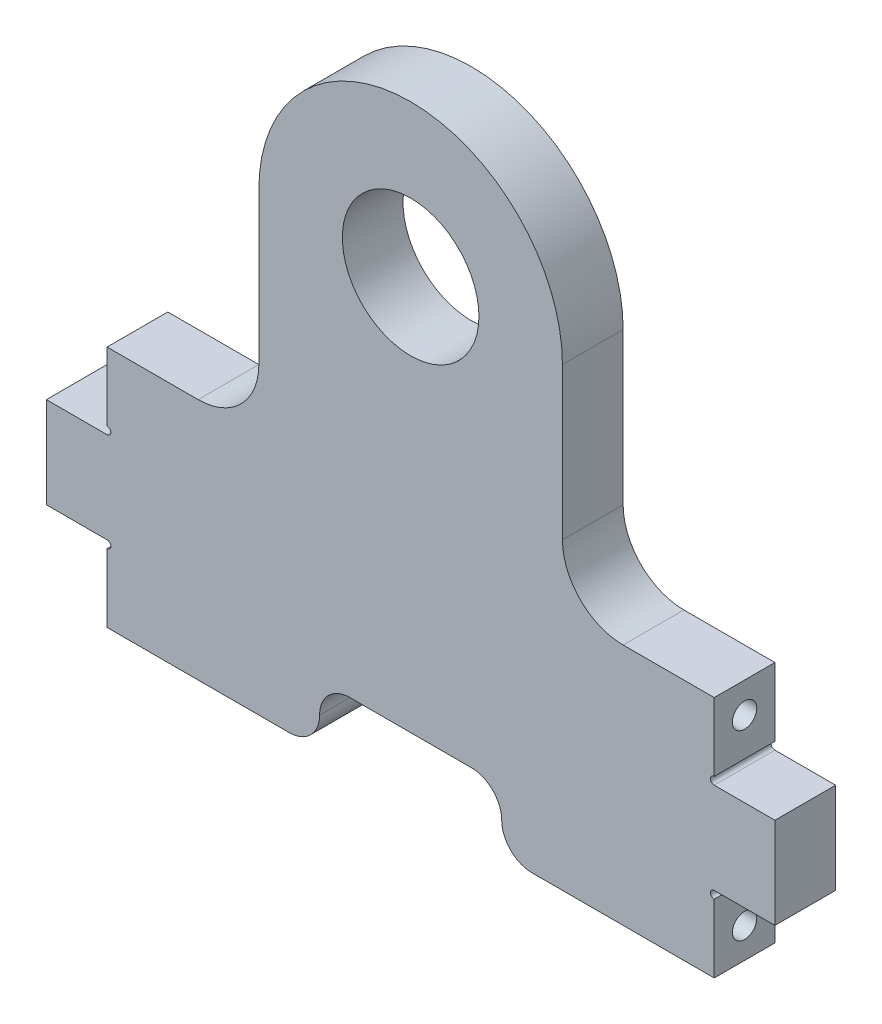
ISO-10303-21;
HEADER;
FILE_DESCRIPTION(('STEP AP214'),'2;1');
FILE_NAME('part.step','',(''),(''),'','','');
FILE_SCHEMA(('AUTOMOTIVE_DESIGN { 1 0 10303 214 1 1 1 1 }'));
ENDSEC;
DATA;
#1=APPLICATION_CONTEXT('core data for automotive mechanical design processes');
#2=APPLICATION_PROTOCOL_DEFINITION('international standard','automotive_design',2000,#1);
#3=PRODUCT_CONTEXT('',#1,'mechanical');
#4=PRODUCT('Part','Part','',(#3));
#5=PRODUCT_RELATED_PRODUCT_CATEGORY('part','',(#4));
#6=PRODUCT_DEFINITION_FORMATION('','',#4);
#7=PRODUCT_DEFINITION_CONTEXT('part definition',#1,'design');
#8=PRODUCT_DEFINITION('design','',#6,#7);
#9=PRODUCT_DEFINITION_SHAPE('','',#8);
#10=(LENGTH_UNIT() NAMED_UNIT(*) SI_UNIT(.MILLI.,.METRE.));
#11=(NAMED_UNIT(*) PLANE_ANGLE_UNIT() SI_UNIT($,.RADIAN.));
#12=(NAMED_UNIT(*) SI_UNIT($,.STERADIAN.) SOLID_ANGLE_UNIT());
#13=UNCERTAINTY_MEASURE_WITH_UNIT(LENGTH_MEASURE(1.E-05),#10,'distance_accuracy_value','');
#14=(GEOMETRIC_REPRESENTATION_CONTEXT(3) GLOBAL_UNCERTAINTY_ASSIGNED_CONTEXT((#13)) GLOBAL_UNIT_ASSIGNED_CONTEXT((#10,
#11,#12)) REPRESENTATION_CONTEXT('',''));
#15=CARTESIAN_POINT('',(0.,0.,0.));
#16=DIRECTION('',(0.,0.,1.));
#17=DIRECTION('',(1.,0.,0.));
#18=AXIS2_PLACEMENT_3D('',#15,#16,#17);
#19=CARTESIAN_POINT('',(-63.5,0.,12.7));
#20=DIRECTION('',(0.,1.,0.));
#21=DIRECTION('',(0.,0.,1.));
#22=AXIS2_PLACEMENT_3D('',#19,#20,#21);
#23=PLANE('',#22);
#24=DIRECTION('',(1.,0.,0.));
#25=VECTOR('',#24,1.);
#26=CARTESIAN_POINT('',(-63.5,0.,0.));
#27=LINE('',#26,#25);
#28=CARTESIAN_POINT('',(-63.5,0.,0.));
#29=VERTEX_POINT('',#28);
#30=CARTESIAN_POINT('',(-25.4,0.,0.));
#31=VERTEX_POINT('',#30);
#32=EDGE_CURVE('E293',#29,#31,#27,.T.);
#33=ORIENTED_EDGE('',*,*,#32,.T.);
#34=DIRECTION('',(0.,0.,1.));
#35=VECTOR('',#34,1.);
#36=CARTESIAN_POINT('',(-25.4,0.,12.7));
#37=LINE('',#36,#35);
#38=CARTESIAN_POINT('',(-25.4,0.,12.7));
#39=VERTEX_POINT('',#38);
#40=EDGE_CURVE('E496',#31,#39,#37,.T.);
#41=ORIENTED_EDGE('',*,*,#40,.T.);
#42=DIRECTION('',(1.,0.,0.));
#43=VECTOR('',#42,1.);
#44=CARTESIAN_POINT('',(-63.5,0.,12.7));
#45=LINE('',#44,#43);
#46=CARTESIAN_POINT('',(-63.5,0.,12.7));
#47=VERTEX_POINT('',#46);
#48=EDGE_CURVE('E276',#47,#39,#45,.T.);
#49=ORIENTED_EDGE('',*,*,#48,.F.);
#50=DIRECTION('',(0.,0.,-1.));
#51=VECTOR('',#50,1.);
#52=CARTESIAN_POINT('',(-63.5,0.,12.7));
#53=LINE('',#52,#51);
#54=EDGE_CURVE('E253',#47,#29,#53,.T.);
#55=ORIENTED_EDGE('',*,*,#54,.T.);
#56=EDGE_LOOP('',(#33,#41,#49,#55));
#57=FACE_BOUND('',#56,.T.);
#58=ADVANCED_FACE('F33',(#57),#23,.F.);
#59=CARTESIAN_POINT('',(0.,0.,12.7));
#60=DIRECTION('',(0.,0.,-1.));
#61=DIRECTION('',(-1.,0.,0.));
#62=AXIS2_PLACEMENT_3D('',#59,#60,#61);
#63=PLANE('',#62);
#64=CARTESIAN_POINT('',(-2.22044604925031E-13,95.2499999999994,12.7));
#65=DIRECTION('',(0.,0.,1.));
#66=DIRECTION('',(1.,0.,0.));
#67=AXIS2_PLACEMENT_3D('',#64,#65,#66);
#68=CIRCLE('',#67,14.2875);
#69=CARTESIAN_POINT('',(14.2874999999998,95.2499999999994,12.7));
#70=VERTEX_POINT('',#69);
#71=EDGE_CURVE('E274',#70,#70,#68,.T.);
#72=ORIENTED_EDGE('',*,*,#71,.F.);
#73=EDGE_LOOP('',(#72));
#74=FACE_BOUND('',#73,.T.);
#75=DIRECTION('',(-1.,0.,0.));
#76=VECTOR('',#75,1.);
#77=CARTESIAN_POINT('',(-19.05,12.7,12.7));
#78=LINE('',#77,#76);
#79=CARTESIAN_POINT('',(12.7,12.7,12.7));
#80=VERTEX_POINT('',#79);
#81=CARTESIAN_POINT('',(-12.7,12.7,12.7));
#82=VERTEX_POINT('',#81);
#83=EDGE_CURVE('E248',#80,#82,#78,.T.);
#84=ORIENTED_EDGE('',*,*,#83,.F.);
#85=CARTESIAN_POINT('',(12.7,6.35,12.7));
#86=DIRECTION('',(0.,0.,-1.));
#87=DIRECTION('',(-1.,0.,0.));
#88=AXIS2_PLACEMENT_3D('',#85,#86,#87);
#89=CIRCLE('',#88,6.35);
#90=CARTESIAN_POINT('',(19.05,6.35,12.7));
#91=VERTEX_POINT('',#90);
#92=EDGE_CURVE('E50',#80,#91,#89,.T.);
#93=ORIENTED_EDGE('',*,*,#92,.T.);
#94=CARTESIAN_POINT('',(25.4,6.35,12.7));
#95=DIRECTION('',(0.,0.,-1.));
#96=DIRECTION('',(-1.,0.,0.));
#97=AXIS2_PLACEMENT_3D('',#94,#95,#96);
#98=CIRCLE('',#97,6.35);
#99=CARTESIAN_POINT('',(25.4,0.,12.7));
#100=VERTEX_POINT('',#99);
#101=EDGE_CURVE('E494',#91,#100,#98,.F.);
#102=ORIENTED_EDGE('',*,*,#101,.T.);
#103=CARTESIAN_POINT('',(63.5,0.,12.7));
#104=VERTEX_POINT('',#103);
#105=EDGE_CURVE('E258',#100,#104,#45,.T.);
#106=ORIENTED_EDGE('',*,*,#105,.T.);
#107=DIRECTION('',(0.,1.,0.));
#108=VECTOR('',#107,1.);
#109=CARTESIAN_POINT('',(63.5,0.,12.7));
#110=LINE('',#109,#108);
#111=CARTESIAN_POINT('',(63.5,14.2875,12.7));
#112=VERTEX_POINT('',#111);
#113=EDGE_CURVE('E307',#104,#112,#110,.T.);
#114=ORIENTED_EDGE('',*,*,#113,.T.);
#115=CARTESIAN_POINT('',(63.5,15.08125,12.7));
#116=DIRECTION('',(0.,0.,1.));
#117=DIRECTION('',(1.,0.,0.));
#118=AXIS2_PLACEMENT_3D('',#115,#116,#117);
#119=CIRCLE('',#118,0.793749999999993);
#120=CARTESIAN_POINT('',(63.5,15.875,12.7));
#121=VERTEX_POINT('',#120);
#122=EDGE_CURVE('E570',#121,#112,#119,.T.);
#123=ORIENTED_EDGE('',*,*,#122,.F.);
#124=DIRECTION('',(-1.,0.,0.));
#125=VECTOR('',#124,1.);
#126=CARTESIAN_POINT('',(76.2,15.875,12.7));
#127=LINE('',#126,#125);
#128=CARTESIAN_POINT('',(76.2,15.875,12.7));
#129=VERTEX_POINT('',#128);
#130=EDGE_CURVE('E346',#129,#121,#127,.T.);
#131=ORIENTED_EDGE('',*,*,#130,.F.);
#132=DIRECTION('',(0.,-1.,0.));
#133=VECTOR('',#132,1.);
#134=CARTESIAN_POINT('',(76.2,34.925,12.7));
#135=LINE('',#134,#133);
#136=CARTESIAN_POINT('',(76.2,34.925,12.7));
#137=VERTEX_POINT('',#136);
#138=EDGE_CURVE('E331',#137,#129,#135,.T.);
#139=ORIENTED_EDGE('',*,*,#138,.F.);
#140=DIRECTION('',(-1.,0.,0.));
#141=VECTOR('',#140,1.);
#142=CARTESIAN_POINT('',(76.2,34.925,12.7));
#143=LINE('',#142,#141);
#144=CARTESIAN_POINT('',(63.5,34.925,12.7));
#145=VERTEX_POINT('',#144);
#146=EDGE_CURVE('E334',#137,#145,#143,.T.);
#147=ORIENTED_EDGE('',*,*,#146,.T.);
#148=CARTESIAN_POINT('',(63.5,35.71875,12.7));
#149=DIRECTION('',(0.,0.,1.));
#150=DIRECTION('',(1.,0.,0.));
#151=AXIS2_PLACEMENT_3D('',#148,#149,#150);
#152=CIRCLE('',#151,0.793749999999993);
#153=CARTESIAN_POINT('',(63.5,36.5125,12.7));
#154=VERTEX_POINT('',#153);
#155=EDGE_CURVE('E581',#154,#145,#152,.T.);
#156=ORIENTED_EDGE('',*,*,#155,.F.);
#157=CARTESIAN_POINT('',(63.5,50.8,12.7));
#158=VERTEX_POINT('',#157);
#159=EDGE_CURVE('E281',#154,#158,#110,.T.);
#160=ORIENTED_EDGE('',*,*,#159,.T.);
#161=DIRECTION('',(1.,0.,0.));
#162=VECTOR('',#161,1.);
#163=CARTESIAN_POINT('',(31.75,50.8,12.7));
#164=LINE('',#163,#162);
#165=CARTESIAN_POINT('',(44.4499999999999,50.8,12.7));
#166=VERTEX_POINT('',#165);
#167=EDGE_CURVE('E391',#166,#158,#164,.T.);
#168=ORIENTED_EDGE('',*,*,#167,.F.);
#169=CARTESIAN_POINT('',(44.4499999999999,63.5,12.7));
#170=DIRECTION('',(0.,0.,-1.));
#171=DIRECTION('',(-1.,0.,0.));
#172=AXIS2_PLACEMENT_3D('',#169,#170,#171);
#173=CIRCLE('',#172,12.7);
#174=CARTESIAN_POINT('',(31.7499999999999,63.4999999999999,12.7));
#175=VERTEX_POINT('',#174);
#176=EDGE_CURVE('E484',#166,#175,#173,.T.);
#177=ORIENTED_EDGE('',*,*,#176,.T.);
#178=DIRECTION('',(0.,-1.,0.));
#179=VECTOR('',#178,1.);
#180=CARTESIAN_POINT('',(31.7499999999998,95.2499999999994,12.7));
#181=LINE('',#180,#179);
#182=CARTESIAN_POINT('',(31.7499999999998,95.2499999999994,12.7));
#183=VERTEX_POINT('',#182);
#184=EDGE_CURVE('E388',#183,#175,#181,.T.);
#185=ORIENTED_EDGE('',*,*,#184,.F.);
#186=CARTESIAN_POINT('',(-2.22044604925031E-13,95.2499999999994,12.7));
#187=DIRECTION('',(0.,0.,-1.));
#188=DIRECTION('',(1.,0.,0.));
#189=AXIS2_PLACEMENT_3D('',#186,#187,#188);
#190=CIRCLE('',#189,31.7499999999998);
#191=CARTESIAN_POINT('',(-31.7499999999998,95.2499999999994,12.7));
#192=VERTEX_POINT('',#191);
#193=EDGE_CURVE('E369',#192,#183,#190,.T.);
#194=ORIENTED_EDGE('',*,*,#193,.F.);
#195=DIRECTION('',(0.,1.,0.));
#196=VECTOR('',#195,1.);
#197=CARTESIAN_POINT('',(-31.75,50.8,12.7));
#198=LINE('',#197,#196);
#199=CARTESIAN_POINT('',(-31.7499999999999,63.4999999999999,12.7));
#200=VERTEX_POINT('',#199);
#201=EDGE_CURVE('E374',#200,#192,#198,.T.);
#202=ORIENTED_EDGE('',*,*,#201,.F.);
#203=CARTESIAN_POINT('',(-44.4499999999999,63.5,12.7));
#204=DIRECTION('',(0.,0.,-1.));
#205=DIRECTION('',(-1.,0.,0.));
#206=AXIS2_PLACEMENT_3D('',#203,#204,#205);
#207=CIRCLE('',#206,12.7);
#208=CARTESIAN_POINT('',(-44.4499999999999,50.8,12.7));
#209=VERTEX_POINT('',#208);
#210=EDGE_CURVE('E632',#200,#209,#207,.T.);
#211=ORIENTED_EDGE('',*,*,#210,.T.);
#212=DIRECTION('',(1.,0.,0.));
#213=VECTOR('',#212,1.);
#214=CARTESIAN_POINT('',(-63.5,50.8,12.7));
#215=LINE('',#214,#213);
#216=CARTESIAN_POINT('',(-63.5,50.8,12.7));
#217=VERTEX_POINT('',#216);
#218=EDGE_CURVE('E394',#217,#209,#215,.T.);
#219=ORIENTED_EDGE('',*,*,#218,.F.);
#220=DIRECTION('',(0.,-1.,0.));
#221=VECTOR('',#220,1.);
#222=CARTESIAN_POINT('',(-63.5,0.,12.7));
#223=LINE('',#222,#221);
#224=CARTESIAN_POINT('',(-63.5,36.5125,12.7));
#225=VERTEX_POINT('',#224);
#226=EDGE_CURVE('E254',#217,#225,#223,.T.);
#227=ORIENTED_EDGE('',*,*,#226,.T.);
#228=CARTESIAN_POINT('',(-63.5,35.71875,12.7));
#229=DIRECTION('',(0.,0.,-1.));
#230=DIRECTION('',(-1.,0.,0.));
#231=AXIS2_PLACEMENT_3D('',#228,#229,#230);
#232=CIRCLE('',#231,0.793749999999993);
#233=CARTESIAN_POINT('',(-63.5,34.925,12.7));
#234=VERTEX_POINT('',#233);
#235=EDGE_CURVE('E240',#225,#234,#232,.T.);
#236=ORIENTED_EDGE('',*,*,#235,.T.);
#237=DIRECTION('',(1.,0.,0.));
#238=VECTOR('',#237,1.);
#239=CARTESIAN_POINT('',(-76.2,34.925,12.7));
#240=LINE('',#239,#238);
#241=CARTESIAN_POINT('',(-76.2,34.925,12.7));
#242=VERTEX_POINT('',#241);
#243=EDGE_CURVE('E547',#242,#234,#240,.T.);
#244=ORIENTED_EDGE('',*,*,#243,.F.);
#245=DIRECTION('',(0.,-1.,0.));
#246=VECTOR('',#245,1.);
#247=CARTESIAN_POINT('',(-76.2,34.925,12.7));
#248=LINE('',#247,#246);
#249=CARTESIAN_POINT('',(-76.2,15.875,12.7));
#250=VERTEX_POINT('',#249);
#251=EDGE_CURVE('E521',#242,#250,#248,.T.);
#252=ORIENTED_EDGE('',*,*,#251,.T.);
#253=DIRECTION('',(1.,0.,0.));
#254=VECTOR('',#253,1.);
#255=CARTESIAN_POINT('',(-76.2,15.875,12.7));
#256=LINE('',#255,#254);
#257=CARTESIAN_POINT('',(-63.5,15.875,12.7));
#258=VERTEX_POINT('',#257);
#259=EDGE_CURVE('E246',#250,#258,#256,.T.);
#260=ORIENTED_EDGE('',*,*,#259,.T.);
#261=CARTESIAN_POINT('',(-63.5,15.08125,12.7));
#262=DIRECTION('',(0.,0.,-1.));
#263=DIRECTION('',(-1.,0.,0.));
#264=AXIS2_PLACEMENT_3D('',#261,#262,#263);
#265=CIRCLE('',#264,0.793749999999993);
#266=CARTESIAN_POINT('',(-63.5,14.2875,12.7));
#267=VERTEX_POINT('',#266);
#268=EDGE_CURVE('E233',#258,#267,#265,.T.);
#269=ORIENTED_EDGE('',*,*,#268,.T.);
#270=EDGE_CURVE('E243',#267,#47,#223,.T.);
#271=ORIENTED_EDGE('',*,*,#270,.T.);
#272=ORIENTED_EDGE('',*,*,#48,.T.);
#273=CARTESIAN_POINT('',(-25.4,6.35,12.7));
#274=DIRECTION('',(0.,0.,-1.));
#275=DIRECTION('',(-1.,0.,0.));
#276=AXIS2_PLACEMENT_3D('',#273,#274,#275);
#277=CIRCLE('',#276,6.35);
#278=CARTESIAN_POINT('',(-19.05,6.35,12.7));
#279=VERTEX_POINT('',#278);
#280=EDGE_CURVE('E57',#39,#279,#277,.F.);
#281=ORIENTED_EDGE('',*,*,#280,.T.);
#282=CARTESIAN_POINT('',(-12.7,6.35,12.7));
#283=DIRECTION('',(0.,0.,-1.));
#284=DIRECTION('',(-1.,0.,0.));
#285=AXIS2_PLACEMENT_3D('',#282,#283,#284);
#286=CIRCLE('',#285,6.35);
#287=EDGE_CURVE('E42',#279,#82,#286,.T.);
#288=ORIENTED_EDGE('',*,*,#287,.T.);
#289=EDGE_LOOP('',(#84,#93,#102,#106,#114,#123,#131,#139,#147,#156,#160,#168,#177,#185,#194,
#202,#211,#219,#227,#236,#244,#252,#260,#269,#271,#272,#281,#288));
#290=FACE_BOUND('',#289,.T.);
#291=ADVANCED_FACE('F242',(#74,#290),#63,.F.);
#292=CARTESIAN_POINT('',(0.,0.,0.));
#293=DIRECTION('',(0.,0.,-1.));
#294=DIRECTION('',(-1.,0.,0.));
#295=AXIS2_PLACEMENT_3D('',#292,#293,#294);
#296=PLANE('',#295);
#297=CARTESIAN_POINT('',(25.4,0.,0.));
#298=VERTEX_POINT('',#297);
#299=CARTESIAN_POINT('',(63.5,0.,0.));
#300=VERTEX_POINT('',#299);
#301=EDGE_CURVE('E286',#298,#300,#27,.T.);
#302=ORIENTED_EDGE('',*,*,#301,.F.);
#303=CARTESIAN_POINT('',(25.4,6.35,0.));
#304=DIRECTION('',(0.,0.,-1.));
#305=DIRECTION('',(-1.,0.,0.));
#306=AXIS2_PLACEMENT_3D('',#303,#304,#305);
#307=CIRCLE('',#306,6.35);
#308=CARTESIAN_POINT('',(19.05,6.35,0.));
#309=VERTEX_POINT('',#308);
#310=EDGE_CURVE('E491',#298,#309,#307,.T.);
#311=ORIENTED_EDGE('',*,*,#310,.T.);
#312=CARTESIAN_POINT('',(12.7,6.35,0.));
#313=DIRECTION('',(0.,0.,-1.));
#314=DIRECTION('',(-1.,0.,0.));
#315=AXIS2_PLACEMENT_3D('',#312,#313,#314);
#316=CIRCLE('',#315,6.35);
#317=CARTESIAN_POINT('',(12.7,12.7,0.));
#318=VERTEX_POINT('',#317);
#319=EDGE_CURVE('E483',#309,#318,#316,.F.);
#320=ORIENTED_EDGE('',*,*,#319,.T.);
#321=DIRECTION('',(1.,0.,0.));
#322=VECTOR('',#321,1.);
#323=CARTESIAN_POINT('',(0.,12.7,0.));
#324=LINE('',#323,#322);
#325=CARTESIAN_POINT('',(-12.7,12.7,0.));
#326=VERTEX_POINT('',#325);
#327=EDGE_CURVE('E477',#326,#318,#324,.T.);
#328=ORIENTED_EDGE('',*,*,#327,.F.);
#329=CARTESIAN_POINT('',(-12.7,6.35,0.));
#330=DIRECTION('',(0.,0.,-1.));
#331=DIRECTION('',(-1.,0.,0.));
#332=AXIS2_PLACEMENT_3D('',#329,#330,#331);
#333=CIRCLE('',#332,6.35);
#334=CARTESIAN_POINT('',(-19.05,6.35,0.));
#335=VERTEX_POINT('',#334);
#336=EDGE_CURVE('E11',#326,#335,#333,.F.);
#337=ORIENTED_EDGE('',*,*,#336,.T.);
#338=CARTESIAN_POINT('',(-25.4,6.35,0.));
#339=DIRECTION('',(0.,0.,-1.));
#340=DIRECTION('',(-1.,0.,0.));
#341=AXIS2_PLACEMENT_3D('',#338,#339,#340);
#342=CIRCLE('',#341,6.35);
#343=EDGE_CURVE('E489',#335,#31,#342,.T.);
#344=ORIENTED_EDGE('',*,*,#343,.T.);
#345=ORIENTED_EDGE('',*,*,#32,.F.);
#346=DIRECTION('',(0.,-1.,0.));
#347=VECTOR('',#346,1.);
#348=CARTESIAN_POINT('',(-63.5,0.,0.));
#349=LINE('',#348,#347);
#350=CARTESIAN_POINT('',(-63.5,14.2875,0.));
#351=VERTEX_POINT('',#350);
#352=EDGE_CURVE('E268',#351,#29,#349,.T.);
#353=ORIENTED_EDGE('',*,*,#352,.F.);
#354=CARTESIAN_POINT('',(-63.5,15.08125,0.));
#355=DIRECTION('',(0.,0.,-1.));
#356=DIRECTION('',(-1.,0.,0.));
#357=AXIS2_PLACEMENT_3D('',#354,#355,#356);
#358=CIRCLE('',#357,0.793749999999993);
#359=CARTESIAN_POINT('',(-63.5,15.875,0.));
#360=VERTEX_POINT('',#359);
#361=EDGE_CURVE('E236',#351,#360,#358,.F.);
#362=ORIENTED_EDGE('',*,*,#361,.T.);
#363=DIRECTION('',(1.,0.,0.));
#364=VECTOR('',#363,1.);
#365=CARTESIAN_POINT('',(-76.2,15.875,0.));
#366=LINE('',#365,#364);
#367=CARTESIAN_POINT('',(-76.2,15.875,0.));
#368=VERTEX_POINT('',#367);
#369=EDGE_CURVE('E542',#368,#360,#366,.T.);
#370=ORIENTED_EDGE('',*,*,#369,.F.);
#371=DIRECTION('',(0.,1.,0.));
#372=VECTOR('',#371,1.);
#373=CARTESIAN_POINT('',(-76.2,34.925,0.));
#374=LINE('',#373,#372);
#375=CARTESIAN_POINT('',(-76.2,34.925,0.));
#376=VERTEX_POINT('',#375);
#377=EDGE_CURVE('E527',#368,#376,#374,.T.);
#378=ORIENTED_EDGE('',*,*,#377,.T.);
#379=DIRECTION('',(1.,0.,0.));
#380=VECTOR('',#379,1.);
#381=CARTESIAN_POINT('',(-76.2,34.925,0.));
#382=LINE('',#381,#380);
#383=CARTESIAN_POINT('',(-63.5,34.925,0.));
#384=VERTEX_POINT('',#383);
#385=EDGE_CURVE('E544',#376,#384,#382,.T.);
#386=ORIENTED_EDGE('',*,*,#385,.T.);
#387=CARTESIAN_POINT('',(-63.5,35.71875,0.));
#388=DIRECTION('',(0.,0.,-1.));
#389=DIRECTION('',(-1.,0.,0.));
#390=AXIS2_PLACEMENT_3D('',#387,#388,#389);
#391=CIRCLE('',#390,0.793749999999993);
#392=CARTESIAN_POINT('',(-63.5,36.5125,0.));
#393=VERTEX_POINT('',#392);
#394=EDGE_CURVE('E514',#384,#393,#391,.F.);
#395=ORIENTED_EDGE('',*,*,#394,.T.);
#396=CARTESIAN_POINT('',(-63.5,50.8,0.));
#397=VERTEX_POINT('',#396);
#398=EDGE_CURVE('E283',#397,#393,#349,.T.);
#399=ORIENTED_EDGE('',*,*,#398,.F.);
#400=DIRECTION('',(1.,0.,0.));
#401=VECTOR('',#400,1.);
#402=CARTESIAN_POINT('',(-63.5,50.8,0.));
#403=LINE('',#402,#401);
#404=CARTESIAN_POINT('',(-44.4499999999999,50.8,0.));
#405=VERTEX_POINT('',#404);
#406=EDGE_CURVE('E380',#397,#405,#403,.T.);
#407=ORIENTED_EDGE('',*,*,#406,.T.);
#408=CARTESIAN_POINT('',(-44.4499999999999,63.5,0.));
#409=DIRECTION('',(0.,0.,-1.));
#410=DIRECTION('',(-1.,0.,0.));
#411=AXIS2_PLACEMENT_3D('',#408,#409,#410);
#412=CIRCLE('',#411,12.7);
#413=CARTESIAN_POINT('',(-31.7499999999999,63.4999999999999,0.));
#414=VERTEX_POINT('',#413);
#415=EDGE_CURVE('E634',#405,#414,#412,.F.);
#416=ORIENTED_EDGE('',*,*,#415,.T.);
#417=DIRECTION('',(0.,1.,0.));
#418=VECTOR('',#417,1.);
#419=CARTESIAN_POINT('',(-31.75,50.8,0.));
#420=LINE('',#419,#418);
#421=CARTESIAN_POINT('',(-31.7499999999998,95.2499999999994,0.));
#422=VERTEX_POINT('',#421);
#423=EDGE_CURVE('E383',#414,#422,#420,.T.);
#424=ORIENTED_EDGE('',*,*,#423,.T.);
#425=CARTESIAN_POINT('',(-2.22044604925031E-13,95.2499999999994,0.));
#426=DIRECTION('',(0.,0.,-1.));
#427=DIRECTION('',(1.,0.,0.));
#428=AXIS2_PLACEMENT_3D('',#425,#426,#427);
#429=CIRCLE('',#428,31.7499999999998);
#430=CARTESIAN_POINT('',(31.7499999999998,95.2499999999994,0.));
#431=VERTEX_POINT('',#430);
#432=EDGE_CURVE('E370',#422,#431,#429,.T.);
#433=ORIENTED_EDGE('',*,*,#432,.T.);
#434=DIRECTION('',(0.,-1.,0.));
#435=VECTOR('',#434,1.);
#436=CARTESIAN_POINT('',(31.7499999999998,95.2499999999994,0.));
#437=LINE('',#436,#435);
#438=CARTESIAN_POINT('',(31.7499999999999,63.4999999999999,0.));
#439=VERTEX_POINT('',#438);
#440=EDGE_CURVE('E373',#431,#439,#437,.T.);
#441=ORIENTED_EDGE('',*,*,#440,.T.);
#442=CARTESIAN_POINT('',(44.4499999999999,63.5,0.));
#443=DIRECTION('',(0.,0.,-1.));
#444=DIRECTION('',(-1.,0.,0.));
#445=AXIS2_PLACEMENT_3D('',#442,#443,#444);
#446=CIRCLE('',#445,12.7);
#447=CARTESIAN_POINT('',(44.4499999999999,50.8,0.));
#448=VERTEX_POINT('',#447);
#449=EDGE_CURVE('E305',#439,#448,#446,.F.);
#450=ORIENTED_EDGE('',*,*,#449,.T.);
#451=DIRECTION('',(1.,0.,0.));
#452=VECTOR('',#451,1.);
#453=CARTESIAN_POINT('',(31.75,50.8,0.));
#454=LINE('',#453,#452);
#455=CARTESIAN_POINT('',(63.5,50.8,0.));
#456=VERTEX_POINT('',#455);
#457=EDGE_CURVE('E377',#448,#456,#454,.T.);
#458=ORIENTED_EDGE('',*,*,#457,.T.);
#459=DIRECTION('',(0.,1.,0.));
#460=VECTOR('',#459,1.);
#461=CARTESIAN_POINT('',(63.5,0.,0.));
#462=LINE('',#461,#460);
#463=CARTESIAN_POINT('',(63.5,36.5125,0.));
#464=VERTEX_POINT('',#463);
#465=EDGE_CURVE('E261',#464,#456,#462,.T.);
#466=ORIENTED_EDGE('',*,*,#465,.F.);
#467=CARTESIAN_POINT('',(63.5,35.71875,0.));
#468=DIRECTION('',(0.,0.,-1.));
#469=DIRECTION('',(-1.,0.,0.));
#470=AXIS2_PLACEMENT_3D('',#467,#468,#469);
#471=CIRCLE('',#470,0.793749999999993);
#472=CARTESIAN_POINT('',(63.5,34.925,0.));
#473=VERTEX_POINT('',#472);
#474=EDGE_CURVE('E585',#473,#464,#471,.T.);
#475=ORIENTED_EDGE('',*,*,#474,.F.);
#476=DIRECTION('',(-1.,0.,0.));
#477=VECTOR('',#476,1.);
#478=CARTESIAN_POINT('',(76.2,34.925,0.));
#479=LINE('',#478,#477);
#480=CARTESIAN_POINT('',(76.2,34.925,0.));
#481=VERTEX_POINT('',#480);
#482=EDGE_CURVE('E337',#481,#473,#479,.T.);
#483=ORIENTED_EDGE('',*,*,#482,.F.);
#484=DIRECTION('',(0.,1.,0.));
#485=VECTOR('',#484,1.);
#486=CARTESIAN_POINT('',(76.2,34.925,0.));
#487=LINE('',#486,#485);
#488=CARTESIAN_POINT('',(76.2,15.875,0.));
#489=VERTEX_POINT('',#488);
#490=EDGE_CURVE('E594',#489,#481,#487,.T.);
#491=ORIENTED_EDGE('',*,*,#490,.F.);
#492=DIRECTION('',(-1.,0.,0.));
#493=VECTOR('',#492,1.);
#494=CARTESIAN_POINT('',(76.2,15.875,0.));
#495=LINE('',#494,#493);
#496=CARTESIAN_POINT('',(63.5,15.875,0.));
#497=VERTEX_POINT('',#496);
#498=EDGE_CURVE('E316',#489,#497,#495,.T.);
#499=ORIENTED_EDGE('',*,*,#498,.T.);
#500=CARTESIAN_POINT('',(63.5,15.08125,0.));
#501=DIRECTION('',(0.,0.,-1.));
#502=DIRECTION('',(-1.,0.,0.));
#503=AXIS2_PLACEMENT_3D('',#500,#501,#502);
#504=CIRCLE('',#503,0.793749999999993);
#505=CARTESIAN_POINT('',(63.5,14.2875,0.));
#506=VERTEX_POINT('',#505);
#507=EDGE_CURVE('E572',#506,#497,#504,.T.);
#508=ORIENTED_EDGE('',*,*,#507,.F.);
#509=EDGE_CURVE('E255',#300,#506,#462,.T.);
#510=ORIENTED_EDGE('',*,*,#509,.F.);
#511=EDGE_LOOP('',(#302,#311,#320,#328,#337,#344,#345,#353,#362,#370,#378,#386,#395,#399,#407,
#416,#424,#433,#441,#450,#458,#466,#475,#483,#491,#499,#508,#510));
#512=FACE_BOUND('',#511,.T.);
#513=CARTESIAN_POINT('',(-2.22044604925031E-13,95.2499999999994,0.));
#514=DIRECTION('',(0.,0.,1.));
#515=DIRECTION('',(1.,0.,0.));
#516=AXIS2_PLACEMENT_3D('',#513,#514,#515);
#517=CIRCLE('',#516,14.2875);
#518=CARTESIAN_POINT('',(14.2874999999998,95.2499999999994,0.));
#519=VERTEX_POINT('',#518);
#520=EDGE_CURVE('E406',#519,#519,#517,.T.);
#521=ORIENTED_EDGE('',*,*,#520,.T.);
#522=EDGE_LOOP('',(#521));
#523=FACE_BOUND('',#522,.T.);
#524=ADVANCED_FACE('F416',(#512,#523),#296,.T.);
#525=CARTESIAN_POINT('',(-63.5,0.,12.7));
#526=DIRECTION('',(1.,0.,0.));
#527=DIRECTION('',(0.,0.,-1.));
#528=AXIS2_PLACEMENT_3D('',#525,#526,#527);
#529=PLANE('',#528);
#530=CARTESIAN_POINT('',(-63.5,6.34999999999999,6.34999999999999));
#531=DIRECTION('',(-1.,0.,0.));
#532=DIRECTION('',(0.,0.,1.));
#533=AXIS2_PLACEMENT_3D('',#530,#531,#532);
#534=CIRCLE('',#533,2.55269999999999);
#535=CARTESIAN_POINT('',(-63.5,6.34999999999999,8.90269999999998));
#536=VERTEX_POINT('',#535);
#537=EDGE_CURVE('E561',#536,#536,#534,.T.);
#538=ORIENTED_EDGE('',*,*,#537,.F.);
#539=EDGE_LOOP('',(#538));
#540=FACE_BOUND('',#539,.T.);
#541=DIRECTION('',(0.,0.,1.));
#542=VECTOR('',#541,1.);
#543=CARTESIAN_POINT('',(-63.5,14.2875,-4.99999999997031E-05));
#544=LINE('',#543,#542);
#545=EDGE_CURVE('E230',#351,#267,#544,.T.);
#546=ORIENTED_EDGE('',*,*,#545,.F.);
#547=ORIENTED_EDGE('',*,*,#352,.T.);
#548=ORIENTED_EDGE('',*,*,#54,.F.);
#549=ORIENTED_EDGE('',*,*,#270,.F.);
#550=EDGE_LOOP('',(#546,#547,#548,#549));
#551=FACE_BOUND('',#550,.T.);
#552=ADVANCED_FACE('F251',(#540,#551),#529,.F.);
#553=CARTESIAN_POINT('',(-63.5,44.45,6.34999999999999));
#554=DIRECTION('',(-1.,0.,0.));
#555=DIRECTION('',(0.,0.,1.));
#556=AXIS2_PLACEMENT_3D('',#553,#554,#555);
#557=CIRCLE('',#556,2.55269999999999);
#558=CARTESIAN_POINT('',(-63.5,44.45,8.90269999999999));
#559=VERTEX_POINT('',#558);
#560=EDGE_CURVE('E536',#559,#559,#557,.T.);
#561=ORIENTED_EDGE('',*,*,#560,.F.);
#562=EDGE_LOOP('',(#561));
#563=FACE_BOUND('',#562,.T.);
#564=DIRECTION('',(0.,0.,1.));
#565=VECTOR('',#564,1.);
#566=CARTESIAN_POINT('',(-63.5,36.5125,-4.99999999997031E-05));
#567=LINE('',#566,#565);
#568=EDGE_CURVE('E517',#225,#393,#567,.F.);
#569=ORIENTED_EDGE('',*,*,#568,.F.);
#570=ORIENTED_EDGE('',*,*,#226,.F.);
#571=DIRECTION('',(0.,0.,1.));
#572=VECTOR('',#571,1.);
#573=CARTESIAN_POINT('',(-63.5,50.8,0.));
#574=LINE('',#573,#572);
#575=EDGE_CURVE('E401',#397,#217,#574,.T.);
#576=ORIENTED_EDGE('',*,*,#575,.F.);
#577=ORIENTED_EDGE('',*,*,#398,.T.);
#578=EDGE_LOOP('',(#569,#570,#576,#577));
#579=FACE_BOUND('',#578,.T.);
#580=ADVANCED_FACE('F433',(#563,#579),#529,.F.);
#581=CARTESIAN_POINT('',(63.5,0.,12.7));
#582=DIRECTION('',(-1.,0.,0.));
#583=DIRECTION('',(0.,0.,1.));
#584=AXIS2_PLACEMENT_3D('',#581,#582,#583);
#585=PLANE('',#584);
#586=CARTESIAN_POINT('',(63.5,44.45,6.34999999999999));
#587=DIRECTION('',(1.,0.,0.));
#588=DIRECTION('',(0.,0.,-1.));
#589=AXIS2_PLACEMENT_3D('',#586,#587,#588);
#590=CIRCLE('',#589,2.55269999999999);
#591=CARTESIAN_POINT('',(63.5,44.45,3.7973));
#592=VERTEX_POINT('',#591);
#593=EDGE_CURVE('E325',#592,#592,#590,.T.);
#594=ORIENTED_EDGE('',*,*,#593,.F.);
#595=EDGE_LOOP('',(#594));
#596=FACE_BOUND('',#595,.T.);
#597=ORIENTED_EDGE('',*,*,#159,.F.);
#598=DIRECTION('',(0.,0.,1.));
#599=VECTOR('',#598,1.);
#600=CARTESIAN_POINT('',(63.5,36.5125,-4.99999999997031E-05));
#601=LINE('',#600,#599);
#602=EDGE_CURVE('E315',#154,#464,#601,.F.);
#603=ORIENTED_EDGE('',*,*,#602,.T.);
#604=ORIENTED_EDGE('',*,*,#465,.T.);
#605=DIRECTION('',(0.,0.,1.));
#606=VECTOR('',#605,1.);
#607=CARTESIAN_POINT('',(63.5,50.8,0.));
#608=LINE('',#607,#606);
#609=EDGE_CURVE('E403',#456,#158,#608,.T.);
#610=ORIENTED_EDGE('',*,*,#609,.T.);
#611=EDGE_LOOP('',(#597,#603,#604,#610));
#612=FACE_BOUND('',#611,.T.);
#613=ADVANCED_FACE('F430',(#596,#612),#585,.F.);
#614=CARTESIAN_POINT('',(63.5,6.34999999999999,6.34999999999999));
#615=DIRECTION('',(1.,0.,0.));
#616=DIRECTION('',(0.,0.,-1.));
#617=AXIS2_PLACEMENT_3D('',#614,#615,#616);
#618=CIRCLE('',#617,2.55269999999999);
#619=CARTESIAN_POINT('',(63.5,6.34999999999999,3.7973));
#620=VERTEX_POINT('',#619);
#621=EDGE_CURVE('E360',#620,#620,#618,.T.);
#622=ORIENTED_EDGE('',*,*,#621,.F.);
#623=EDGE_LOOP('',(#622));
#624=FACE_BOUND('',#623,.T.);
#625=ORIENTED_EDGE('',*,*,#509,.T.);
#626=DIRECTION('',(0.,0.,1.));
#627=VECTOR('',#626,1.);
#628=CARTESIAN_POINT('',(63.5,14.2875,-4.99999999997031E-05));
#629=LINE('',#628,#627);
#630=EDGE_CURVE('E576',#506,#112,#629,.T.);
#631=ORIENTED_EDGE('',*,*,#630,.T.);
#632=ORIENTED_EDGE('',*,*,#113,.F.);
#633=DIRECTION('',(0.,0.,-1.));
#634=VECTOR('',#633,1.);
#635=CARTESIAN_POINT('',(63.5,0.,12.7));
#636=LINE('',#635,#634);
#637=EDGE_CURVE('E299',#104,#300,#636,.T.);
#638=ORIENTED_EDGE('',*,*,#637,.T.);
#639=EDGE_LOOP('',(#625,#631,#632,#638));
#640=FACE_BOUND('',#639,.T.);
#641=ADVANCED_FACE('F432',(#624,#640),#585,.F.);
#642=ORIENTED_EDGE('',*,*,#105,.F.);
#643=DIRECTION('',(0.,0.,-1.));
#644=VECTOR('',#643,1.);
#645=CARTESIAN_POINT('',(25.4,0.,12.7));
#646=LINE('',#645,#644);
#647=EDGE_CURVE('E487',#100,#298,#646,.T.);
#648=ORIENTED_EDGE('',*,*,#647,.T.);
#649=ORIENTED_EDGE('',*,*,#301,.T.);
#650=ORIENTED_EDGE('',*,*,#637,.F.);
#651=EDGE_LOOP('',(#642,#648,#649,#650));
#652=FACE_BOUND('',#651,.T.);
#653=ADVANCED_FACE('F426',(#652),#23,.F.);
#654=CARTESIAN_POINT('',(-2.22044604925031E-13,95.2499999999994,0.));
#655=DIRECTION('',(0.,0.,1.));
#656=DIRECTION('',(1.,0.,0.));
#657=AXIS2_PLACEMENT_3D('',#654,#655,#656);
#658=CYLINDRICAL_SURFACE('',#657,14.2875);
#659=ORIENTED_EDGE('',*,*,#520,.F.);
#660=EDGE_LOOP('',(#659));
#661=FACE_BOUND('',#660,.T.);
#662=ORIENTED_EDGE('',*,*,#71,.T.);
#663=EDGE_LOOP('',(#662));
#664=FACE_BOUND('',#663,.T.);
#665=ADVANCED_FACE('F413',(#661,#664),#658,.F.);
#666=CARTESIAN_POINT('',(-2.22044604925031E-13,95.2499999999994,0.));
#667=DIRECTION('',(0.,0.,1.));
#668=DIRECTION('',(1.,0.,0.));
#669=AXIS2_PLACEMENT_3D('',#666,#667,#668);
#670=CYLINDRICAL_SURFACE('',#669,31.7499999999998);
#671=ORIENTED_EDGE('',*,*,#193,.T.);
#672=DIRECTION('',(0.,0.,1.));
#673=VECTOR('',#672,1.);
#674=CARTESIAN_POINT('',(31.7499999999998,95.2499999999994,0.));
#675=LINE('',#674,#673);
#676=EDGE_CURVE('E385',#431,#183,#675,.T.);
#677=ORIENTED_EDGE('',*,*,#676,.F.);
#678=ORIENTED_EDGE('',*,*,#432,.F.);
#679=DIRECTION('',(0.,0.,1.));
#680=VECTOR('',#679,1.);
#681=CARTESIAN_POINT('',(-31.7499999999998,95.2499999999994,0.));
#682=LINE('',#681,#680);
#683=EDGE_CURVE('E398',#422,#192,#682,.T.);
#684=ORIENTED_EDGE('',*,*,#683,.T.);
#685=EDGE_LOOP('',(#671,#677,#678,#684));
#686=FACE_BOUND('',#685,.T.);
#687=ADVANCED_FACE('F657',(#686),#670,.T.);
#688=CARTESIAN_POINT('',(-31.75,50.8,0.));
#689=DIRECTION('',(1.,0.,0.));
#690=DIRECTION('',(0.,1.,0.));
#691=AXIS2_PLACEMENT_3D('',#688,#689,#690);
#692=PLANE('',#691);
#693=ORIENTED_EDGE('',*,*,#423,.F.);
#694=DIRECTION('',(0.,0.,1.));
#695=VECTOR('',#694,1.);
#696=CARTESIAN_POINT('',(-31.7499999999999,63.4999999999999,12.7));
#697=LINE('',#696,#695);
#698=EDGE_CURVE('E621',#414,#200,#697,.T.);
#699=ORIENTED_EDGE('',*,*,#698,.T.);
#700=ORIENTED_EDGE('',*,*,#201,.T.);
#701=ORIENTED_EDGE('',*,*,#683,.F.);
#702=EDGE_LOOP('',(#693,#699,#700,#701));
#703=FACE_BOUND('',#702,.T.);
#704=ADVANCED_FACE('F653',(#703),#692,.F.);
#705=CARTESIAN_POINT('',(-63.5,50.8,0.));
#706=DIRECTION('',(0.,-1.,0.));
#707=DIRECTION('',(0.,0.,-1.));
#708=AXIS2_PLACEMENT_3D('',#705,#706,#707);
#709=PLANE('',#708);
#710=ORIENTED_EDGE('',*,*,#218,.T.);
#711=DIRECTION('',(0.,0.,1.));
#712=VECTOR('',#711,1.);
#713=CARTESIAN_POINT('',(-44.4499999999999,50.8,0.));
#714=LINE('',#713,#712);
#715=EDGE_CURVE('E623',#209,#405,#714,.F.);
#716=ORIENTED_EDGE('',*,*,#715,.T.);
#717=ORIENTED_EDGE('',*,*,#406,.F.);
#718=ORIENTED_EDGE('',*,*,#575,.T.);
#719=EDGE_LOOP('',(#710,#716,#717,#718));
#720=FACE_BOUND('',#719,.T.);
#721=ADVANCED_FACE('F646',(#720),#709,.F.);
#722=CARTESIAN_POINT('',(31.75,50.8,0.));
#723=DIRECTION('',(0.,-1.,0.));
#724=DIRECTION('',(0.,0.,-1.));
#725=AXIS2_PLACEMENT_3D('',#722,#723,#724);
#726=PLANE('',#725);
#727=ORIENTED_EDGE('',*,*,#457,.F.);
#728=DIRECTION('',(0.,0.,1.));
#729=VECTOR('',#728,1.);
#730=CARTESIAN_POINT('',(44.4499999999999,50.8,12.7));
#731=LINE('',#730,#729);
#732=EDGE_CURVE('E627',#448,#166,#731,.T.);
#733=ORIENTED_EDGE('',*,*,#732,.T.);
#734=ORIENTED_EDGE('',*,*,#167,.T.);
#735=ORIENTED_EDGE('',*,*,#609,.F.);
#736=EDGE_LOOP('',(#727,#733,#734,#735));
#737=FACE_BOUND('',#736,.T.);
#738=ADVANCED_FACE('F644',(#737),#726,.F.);
#739=CARTESIAN_POINT('',(31.7499999999998,95.2499999999994,0.));
#740=DIRECTION('',(-1.,0.,0.));
#741=DIRECTION('',(0.,-1.,0.));
#742=AXIS2_PLACEMENT_3D('',#739,#740,#741);
#743=PLANE('',#742);
#744=ORIENTED_EDGE('',*,*,#184,.T.);
#745=DIRECTION('',(0.,0.,1.));
#746=VECTOR('',#745,1.);
#747=CARTESIAN_POINT('',(31.7499999999999,63.4999999999999,0.));
#748=LINE('',#747,#746);
#749=EDGE_CURVE('E630',#175,#439,#748,.F.);
#750=ORIENTED_EDGE('',*,*,#749,.T.);
#751=ORIENTED_EDGE('',*,*,#440,.F.);
#752=ORIENTED_EDGE('',*,*,#676,.T.);
#753=EDGE_LOOP('',(#744,#750,#751,#752));
#754=FACE_BOUND('',#753,.T.);
#755=ADVANCED_FACE('F445',(#754),#743,.F.);
#756=CARTESIAN_POINT('',(-44.4499999999999,63.5,0.));
#757=DIRECTION('',(0.,0.,-1.));
#758=DIRECTION('',(-1.,0.,0.));
#759=AXIS2_PLACEMENT_3D('',#756,#757,#758);
#760=CYLINDRICAL_SURFACE('',#759,12.7);
#761=ORIENTED_EDGE('',*,*,#415,.F.);
#762=ORIENTED_EDGE('',*,*,#715,.F.);
#763=ORIENTED_EDGE('',*,*,#210,.F.);
#764=ORIENTED_EDGE('',*,*,#698,.F.);
#765=EDGE_LOOP('',(#761,#762,#763,#764));
#766=FACE_BOUND('',#765,.T.);
#767=ADVANCED_FACE('F441',(#766),#760,.F.);
#768=CARTESIAN_POINT('',(44.4499999999999,63.5,0.));
#769=DIRECTION('',(0.,0.,-1.));
#770=DIRECTION('',(-1.,0.,0.));
#771=AXIS2_PLACEMENT_3D('',#768,#769,#770);
#772=CYLINDRICAL_SURFACE('',#771,12.7);
#773=ORIENTED_EDGE('',*,*,#449,.F.);
#774=ORIENTED_EDGE('',*,*,#749,.F.);
#775=ORIENTED_EDGE('',*,*,#176,.F.);
#776=ORIENTED_EDGE('',*,*,#732,.F.);
#777=EDGE_LOOP('',(#773,#774,#775,#776));
#778=FACE_BOUND('',#777,.T.);
#779=ADVANCED_FACE('F444',(#778),#772,.F.);
#780=CARTESIAN_POINT('',(46.99,6.34999999999999,6.34999999999999));
#781=DIRECTION('',(1.,0.,0.));
#782=DIRECTION('',(0.,0.,-1.));
#783=AXIS2_PLACEMENT_3D('',#780,#781,#782);
#784=CONICAL_SURFACE('',#783,2.55269999999999,1.02974425867665);
#785=CARTESIAN_POINT('',(45.4561830978084,6.34999999999999,6.34999999999999));
#786=VERTEX_POINT('',#785);
#787=VERTEX_LOOP('',#786);
#788=FACE_BOUND('',#787,.T.);
#789=CARTESIAN_POINT('',(46.99,6.34999999999999,6.34999999999999));
#790=DIRECTION('',(1.,0.,0.));
#791=DIRECTION('',(0.,0.,-1.));
#792=AXIS2_PLACEMENT_3D('',#789,#790,#791);
#793=CIRCLE('',#792,2.55269999999999);
#794=CARTESIAN_POINT('',(46.99,6.34999999999999,3.7973));
#795=VERTEX_POINT('',#794);
#796=EDGE_CURVE('E364',#795,#795,#793,.T.);
#797=ORIENTED_EDGE('',*,*,#796,.T.);
#798=EDGE_LOOP('',(#797));
#799=FACE_BOUND('',#798,.T.);
#800=ADVANCED_FACE('F449',(#788,#799),#784,.F.);
#801=CARTESIAN_POINT('',(63.5,6.34999999999999,6.34999999999999));
#802=DIRECTION('',(1.,0.,0.));
#803=DIRECTION('',(0.,0.,-1.));
#804=AXIS2_PLACEMENT_3D('',#801,#802,#803);
#805=CYLINDRICAL_SURFACE('',#804,2.55269999999999);
#806=ORIENTED_EDGE('',*,*,#796,.F.);
#807=EDGE_LOOP('',(#806));
#808=FACE_BOUND('',#807,.T.);
#809=ORIENTED_EDGE('',*,*,#621,.T.);
#810=EDGE_LOOP('',(#809));
#811=FACE_BOUND('',#810,.T.);
#812=ADVANCED_FACE('F734',(#808,#811),#805,.F.);
#813=CARTESIAN_POINT('',(46.99,44.45,6.34999999999999));
#814=DIRECTION('',(1.,0.,0.));
#815=DIRECTION('',(0.,0.,-1.));
#816=AXIS2_PLACEMENT_3D('',#813,#814,#815);
#817=CONICAL_SURFACE('',#816,2.55269999999998,1.02974425867665);
#818=CARTESIAN_POINT('',(45.4561830978084,44.45,6.34999999999999));
#819=VERTEX_POINT('',#818);
#820=VERTEX_LOOP('',#819);
#821=FACE_BOUND('',#820,.T.);
#822=CARTESIAN_POINT('',(46.99,44.45,6.34999999999999));
#823=DIRECTION('',(1.,0.,0.));
#824=DIRECTION('',(0.,0.,-1.));
#825=AXIS2_PLACEMENT_3D('',#822,#823,#824);
#826=CIRCLE('',#825,2.55269999999998);
#827=CARTESIAN_POINT('',(46.99,44.45,3.79730000000001));
#828=VERTEX_POINT('',#827);
#829=EDGE_CURVE('E355',#828,#828,#826,.T.);
#830=ORIENTED_EDGE('',*,*,#829,.T.);
#831=EDGE_LOOP('',(#830));
#832=FACE_BOUND('',#831,.T.);
#833=ADVANCED_FACE('F730',(#821,#832),#817,.F.);
#834=CARTESIAN_POINT('',(63.5,44.45,6.34999999999999));
#835=DIRECTION('',(1.,0.,0.));
#836=DIRECTION('',(0.,0.,-1.));
#837=AXIS2_PLACEMENT_3D('',#834,#835,#836);
#838=CYLINDRICAL_SURFACE('',#837,2.55269999999999);
#839=ORIENTED_EDGE('',*,*,#829,.F.);
#840=EDGE_LOOP('',(#839));
#841=FACE_BOUND('',#840,.T.);
#842=ORIENTED_EDGE('',*,*,#593,.T.);
#843=EDGE_LOOP('',(#842));
#844=FACE_BOUND('',#843,.T.);
#845=ADVANCED_FACE('F727',(#841,#844),#838,.F.);
#846=CARTESIAN_POINT('',(76.2,15.875,12.7));
#847=DIRECTION('',(0.,1.,0.));
#848=DIRECTION('',(0.,0.,1.));
#849=AXIS2_PLACEMENT_3D('',#846,#847,#848);
#850=PLANE('',#849);
#851=DIRECTION('',(0.,0.,-1.));
#852=VECTOR('',#851,1.);
#853=CARTESIAN_POINT('',(63.5,15.875,12.7));
#854=LINE('',#853,#852);
#855=EDGE_CURVE('E310',#121,#497,#854,.T.);
#856=ORIENTED_EDGE('',*,*,#855,.T.);
#857=ORIENTED_EDGE('',*,*,#498,.F.);
#858=DIRECTION('',(0.,0.,-1.));
#859=VECTOR('',#858,1.);
#860=CARTESIAN_POINT('',(76.2,15.875,12.7));
#861=LINE('',#860,#859);
#862=EDGE_CURVE('E593',#129,#489,#861,.T.);
#863=ORIENTED_EDGE('',*,*,#862,.F.);
#864=ORIENTED_EDGE('',*,*,#130,.T.);
#865=EDGE_LOOP('',(#856,#857,#863,#864));
#866=FACE_BOUND('',#865,.T.);
#867=ADVANCED_FACE('F610',(#866),#850,.F.);
#868=CARTESIAN_POINT('',(76.2,34.925,12.7));
#869=DIRECTION('',(0.,-1.,0.));
#870=DIRECTION('',(0.,0.,-1.));
#871=AXIS2_PLACEMENT_3D('',#868,#869,#870);
#872=PLANE('',#871);
#873=DIRECTION('',(0.,0.,1.));
#874=VECTOR('',#873,1.);
#875=CARTESIAN_POINT('',(63.5,34.925,12.7));
#876=LINE('',#875,#874);
#877=EDGE_CURVE('E314',#473,#145,#876,.T.);
#878=ORIENTED_EDGE('',*,*,#877,.T.);
#879=ORIENTED_EDGE('',*,*,#146,.F.);
#880=DIRECTION('',(0.,0.,1.));
#881=VECTOR('',#880,1.);
#882=CARTESIAN_POINT('',(76.2,34.925,12.7));
#883=LINE('',#882,#881);
#884=EDGE_CURVE('E321',#481,#137,#883,.T.);
#885=ORIENTED_EDGE('',*,*,#884,.F.);
#886=ORIENTED_EDGE('',*,*,#482,.T.);
#887=EDGE_LOOP('',(#878,#879,#885,#886));
#888=FACE_BOUND('',#887,.T.);
#889=ADVANCED_FACE('F599',(#888),#872,.F.);
#890=CARTESIAN_POINT('',(76.2,0.,0.));
#891=DIRECTION('',(1.,0.,0.));
#892=DIRECTION('',(0.,0.,-1.));
#893=AXIS2_PLACEMENT_3D('',#890,#891,#892);
#894=PLANE('',#893);
#895=ORIENTED_EDGE('',*,*,#138,.T.);
#896=ORIENTED_EDGE('',*,*,#862,.T.);
#897=ORIENTED_EDGE('',*,*,#490,.T.);
#898=ORIENTED_EDGE('',*,*,#884,.T.);
#899=EDGE_LOOP('',(#895,#896,#897,#898));
#900=FACE_BOUND('',#899,.T.);
#901=ADVANCED_FACE('F597',(#900),#894,.T.);
#902=CARTESIAN_POINT('',(63.5,35.71875,-4.99999999997031E-05));
#903=DIRECTION('',(0.,0.,1.));
#904=DIRECTION('',(1.,0.,0.));
#905=AXIS2_PLACEMENT_3D('',#902,#903,#904);
#906=CYLINDRICAL_SURFACE('',#905,0.793749999999993);
#907=ORIENTED_EDGE('',*,*,#155,.T.);
#908=ORIENTED_EDGE('',*,*,#877,.F.);
#909=ORIENTED_EDGE('',*,*,#474,.T.);
#910=ORIENTED_EDGE('',*,*,#602,.F.);
#911=EDGE_LOOP('',(#907,#908,#909,#910));
#912=FACE_BOUND('',#911,.T.);
#913=ADVANCED_FACE('F614',(#912),#906,.F.);
#914=CARTESIAN_POINT('',(63.5,15.08125,-4.99999999997031E-05));
#915=DIRECTION('',(0.,0.,1.));
#916=DIRECTION('',(1.,0.,0.));
#917=AXIS2_PLACEMENT_3D('',#914,#915,#916);
#918=CYLINDRICAL_SURFACE('',#917,0.793749999999993);
#919=ORIENTED_EDGE('',*,*,#507,.T.);
#920=ORIENTED_EDGE('',*,*,#855,.F.);
#921=ORIENTED_EDGE('',*,*,#122,.T.);
#922=ORIENTED_EDGE('',*,*,#630,.F.);
#923=EDGE_LOOP('',(#919,#920,#921,#922));
#924=FACE_BOUND('',#923,.T.);
#925=ADVANCED_FACE('F604',(#924),#918,.F.);
#926=CARTESIAN_POINT('',(-46.99,6.34999999999999,6.34999999999999));
#927=DIRECTION('',(-1.,0.,0.));
#928=DIRECTION('',(0.,0.,1.));
#929=AXIS2_PLACEMENT_3D('',#926,#927,#928);
#930=CONICAL_SURFACE('',#929,2.55269999999999,1.02974425867665);
#931=CARTESIAN_POINT('',(-45.4561830978084,6.34999999999999,6.34999999999999));
#932=VERTEX_POINT('',#931);
#933=VERTEX_LOOP('',#932);
#934=FACE_BOUND('',#933,.T.);
#935=CARTESIAN_POINT('',(-46.99,6.34999999999999,6.34999999999999));
#936=DIRECTION('',(-1.,0.,0.));
#937=DIRECTION('',(0.,0.,1.));
#938=AXIS2_PLACEMENT_3D('',#935,#936,#937);
#939=CIRCLE('',#938,2.55269999999999);
#940=CARTESIAN_POINT('',(-46.99,6.34999999999999,8.90269999999997));
#941=VERTEX_POINT('',#940);
#942=EDGE_CURVE('E565',#941,#941,#939,.T.);
#943=ORIENTED_EDGE('',*,*,#942,.T.);
#944=EDGE_LOOP('',(#943));
#945=FACE_BOUND('',#944,.T.);
#946=ADVANCED_FACE('F712',(#934,#945),#930,.F.);
#947=CARTESIAN_POINT('',(-63.5,6.34999999999999,6.34999999999999));
#948=DIRECTION('',(-1.,0.,0.));
#949=DIRECTION('',(0.,0.,1.));
#950=AXIS2_PLACEMENT_3D('',#947,#948,#949);
#951=CYLINDRICAL_SURFACE('',#950,2.55269999999999);
#952=ORIENTED_EDGE('',*,*,#942,.F.);
#953=EDGE_LOOP('',(#952));
#954=FACE_BOUND('',#953,.T.);
#955=ORIENTED_EDGE('',*,*,#537,.T.);
#956=EDGE_LOOP('',(#955));
#957=FACE_BOUND('',#956,.T.);
#958=ADVANCED_FACE('F708',(#954,#957),#951,.F.);
#959=CARTESIAN_POINT('',(-46.99,44.45,6.34999999999999));
#960=DIRECTION('',(-1.,0.,0.));
#961=DIRECTION('',(0.,0.,1.));
#962=AXIS2_PLACEMENT_3D('',#959,#960,#961);
#963=CONICAL_SURFACE('',#962,2.55269999999998,1.02974425867665);
#964=CARTESIAN_POINT('',(-45.4561830978084,44.45,6.34999999999999));
#965=VERTEX_POINT('',#964);
#966=VERTEX_LOOP('',#965);
#967=FACE_BOUND('',#966,.T.);
#968=CARTESIAN_POINT('',(-46.99,44.45,6.34999999999999));
#969=DIRECTION('',(-1.,0.,0.));
#970=DIRECTION('',(0.,0.,1.));
#971=AXIS2_PLACEMENT_3D('',#968,#969,#970);
#972=CIRCLE('',#971,2.55269999999998);
#973=CARTESIAN_POINT('',(-46.99,44.45,8.90269999999998));
#974=VERTEX_POINT('',#973);
#975=EDGE_CURVE('E557',#974,#974,#972,.T.);
#976=ORIENTED_EDGE('',*,*,#975,.T.);
#977=EDGE_LOOP('',(#976));
#978=FACE_BOUND('',#977,.T.);
#979=ADVANCED_FACE('F704',(#967,#978),#963,.F.);
#980=CARTESIAN_POINT('',(-63.5,44.45,6.34999999999999));
#981=DIRECTION('',(-1.,0.,0.));
#982=DIRECTION('',(0.,0.,1.));
#983=AXIS2_PLACEMENT_3D('',#980,#981,#982);
#984=CYLINDRICAL_SURFACE('',#983,2.55269999999999);
#985=ORIENTED_EDGE('',*,*,#975,.F.);
#986=EDGE_LOOP('',(#985));
#987=FACE_BOUND('',#986,.T.);
#988=ORIENTED_EDGE('',*,*,#560,.T.);
#989=EDGE_LOOP('',(#988));
#990=FACE_BOUND('',#989,.T.);
#991=ADVANCED_FACE('F698',(#987,#990),#984,.F.);
#992=CARTESIAN_POINT('',(-76.2,34.925,12.7));
#993=DIRECTION('',(0.,1.,0.));
#994=DIRECTION('',(0.,0.,1.));
#995=AXIS2_PLACEMENT_3D('',#992,#993,#994);
#996=PLANE('',#995);
#997=DIRECTION('',(0.,0.,1.));
#998=VECTOR('',#997,1.);
#999=CARTESIAN_POINT('',(-63.5,34.925,12.7));
#1000=LINE('',#999,#998);
#1001=EDGE_CURVE('E287',#384,#234,#1000,.T.);
#1002=ORIENTED_EDGE('',*,*,#1001,.F.);
#1003=ORIENTED_EDGE('',*,*,#385,.F.);
#1004=DIRECTION('',(0.,0.,1.));
#1005=VECTOR('',#1004,1.);
#1006=CARTESIAN_POINT('',(-76.2,34.925,12.7));
#1007=LINE('',#1006,#1005);
#1008=EDGE_CURVE('E523',#376,#242,#1007,.T.);
#1009=ORIENTED_EDGE('',*,*,#1008,.T.);
#1010=ORIENTED_EDGE('',*,*,#243,.T.);
#1011=EDGE_LOOP('',(#1002,#1003,#1009,#1010));
#1012=FACE_BOUND('',#1011,.T.);
#1013=ADVANCED_FACE('F682',(#1012),#996,.T.);
#1014=CARTESIAN_POINT('',(-76.2,15.875,12.7));
#1015=DIRECTION('',(0.,-1.,0.));
#1016=DIRECTION('',(0.,0.,-1.));
#1017=AXIS2_PLACEMENT_3D('',#1014,#1015,#1016);
#1018=PLANE('',#1017);
#1019=DIRECTION('',(0.,0.,-1.));
#1020=VECTOR('',#1019,1.);
#1021=CARTESIAN_POINT('',(-63.5,15.875,12.7));
#1022=LINE('',#1021,#1020);
#1023=EDGE_CURVE('E524',#258,#360,#1022,.T.);
#1024=ORIENTED_EDGE('',*,*,#1023,.F.);
#1025=ORIENTED_EDGE('',*,*,#259,.F.);
#1026=DIRECTION('',(0.,0.,-1.));
#1027=VECTOR('',#1026,1.);
#1028=CARTESIAN_POINT('',(-76.2,15.875,12.7));
#1029=LINE('',#1028,#1027);
#1030=EDGE_CURVE('E530',#250,#368,#1029,.T.);
#1031=ORIENTED_EDGE('',*,*,#1030,.T.);
#1032=ORIENTED_EDGE('',*,*,#369,.T.);
#1033=EDGE_LOOP('',(#1024,#1025,#1031,#1032));
#1034=FACE_BOUND('',#1033,.T.);
#1035=ADVANCED_FACE('F690',(#1034),#1018,.T.);
#1036=CARTESIAN_POINT('',(-76.2,0.,0.));
#1037=DIRECTION('',(-1.,0.,0.));
#1038=DIRECTION('',(0.,0.,-1.));
#1039=AXIS2_PLACEMENT_3D('',#1036,#1037,#1038);
#1040=PLANE('',#1039);
#1041=ORIENTED_EDGE('',*,*,#251,.F.);
#1042=ORIENTED_EDGE('',*,*,#1008,.F.);
#1043=ORIENTED_EDGE('',*,*,#377,.F.);
#1044=ORIENTED_EDGE('',*,*,#1030,.F.);
#1045=EDGE_LOOP('',(#1041,#1042,#1043,#1044));
#1046=FACE_BOUND('',#1045,.T.);
#1047=ADVANCED_FACE('F686',(#1046),#1040,.T.);
#1048=CARTESIAN_POINT('',(-63.5,35.71875,-4.99999999997031E-05));
#1049=DIRECTION('',(0.,0.,1.));
#1050=DIRECTION('',(1.,0.,0.));
#1051=AXIS2_PLACEMENT_3D('',#1048,#1049,#1050);
#1052=CYLINDRICAL_SURFACE('',#1051,0.793749999999993);
#1053=ORIENTED_EDGE('',*,*,#568,.T.);
#1054=ORIENTED_EDGE('',*,*,#394,.F.);
#1055=ORIENTED_EDGE('',*,*,#1001,.T.);
#1056=ORIENTED_EDGE('',*,*,#235,.F.);
#1057=EDGE_LOOP('',(#1053,#1054,#1055,#1056));
#1058=FACE_BOUND('',#1057,.T.);
#1059=ADVANCED_FACE('F681',(#1058),#1052,.F.);
#1060=CARTESIAN_POINT('',(-63.5,15.08125,-4.99999999997031E-05));
#1061=DIRECTION('',(0.,0.,1.));
#1062=DIRECTION('',(1.,0.,0.));
#1063=AXIS2_PLACEMENT_3D('',#1060,#1061,#1062);
#1064=CYLINDRICAL_SURFACE('',#1063,0.793749999999993);
#1065=ORIENTED_EDGE('',*,*,#545,.T.);
#1066=ORIENTED_EDGE('',*,*,#268,.F.);
#1067=ORIENTED_EDGE('',*,*,#1023,.T.);
#1068=ORIENTED_EDGE('',*,*,#361,.F.);
#1069=EDGE_LOOP('',(#1065,#1066,#1067,#1068));
#1070=FACE_BOUND('',#1069,.T.);
#1071=ADVANCED_FACE('F232',(#1070),#1064,.F.);
#1072=CARTESIAN_POINT('',(-19.05,12.7,-4.99999999997031E-05));
#1073=DIRECTION('',(0.,1.,0.));
#1074=DIRECTION('',(0.,0.,1.));
#1075=AXIS2_PLACEMENT_3D('',#1072,#1073,#1074);
#1076=PLANE('',#1075);
#1077=ORIENTED_EDGE('',*,*,#327,.T.);
#1078=DIRECTION('',(0.,0.,1.));
#1079=VECTOR('',#1078,1.);
#1080=CARTESIAN_POINT('',(12.7,12.7,12.7));
#1081=LINE('',#1080,#1079);
#1082=EDGE_CURVE('E479',#318,#80,#1081,.T.);
#1083=ORIENTED_EDGE('',*,*,#1082,.T.);
#1084=ORIENTED_EDGE('',*,*,#83,.T.);
#1085=DIRECTION('',(0.,0.,1.));
#1086=VECTOR('',#1085,1.);
#1087=CARTESIAN_POINT('',(-12.7,12.7,0.));
#1088=LINE('',#1087,#1086);
#1089=EDGE_CURVE('E470',#82,#326,#1088,.F.);
#1090=ORIENTED_EDGE('',*,*,#1089,.T.);
#1091=EDGE_LOOP('',(#1077,#1083,#1084,#1090));
#1092=FACE_BOUND('',#1091,.T.);
#1093=ADVANCED_FACE('F457',(#1092),#1076,.F.);
#1094=CARTESIAN_POINT('',(25.4,6.35,12.7));
#1095=DIRECTION('',(0.,0.,-1.));
#1096=DIRECTION('',(-1.,0.,0.));
#1097=AXIS2_PLACEMENT_3D('',#1094,#1095,#1096);
#1098=CYLINDRICAL_SURFACE('',#1097,6.35);
#1099=DIRECTION('',(0.,0.,-1.));
#1100=VECTOR('',#1099,1.);
#1101=CARTESIAN_POINT('',(19.05,6.35,-4.99999999997031E-05));
#1102=LINE('',#1101,#1100);
#1103=EDGE_CURVE('E500',#309,#91,#1102,.F.);
#1104=ORIENTED_EDGE('',*,*,#1103,.F.);
#1105=ORIENTED_EDGE('',*,*,#310,.F.);
#1106=ORIENTED_EDGE('',*,*,#647,.F.);
#1107=ORIENTED_EDGE('',*,*,#101,.F.);
#1108=EDGE_LOOP('',(#1104,#1105,#1106,#1107));
#1109=FACE_BOUND('',#1108,.T.);
#1110=ADVANCED_FACE('F454',(#1109),#1098,.T.);
#1111=CARTESIAN_POINT('',(12.7,6.35,-4.99999999997031E-05));
#1112=DIRECTION('',(0.,0.,-1.));
#1113=DIRECTION('',(-1.,0.,0.));
#1114=AXIS2_PLACEMENT_3D('',#1111,#1112,#1113);
#1115=CYLINDRICAL_SURFACE('',#1114,6.35);
#1116=ORIENTED_EDGE('',*,*,#319,.F.);
#1117=ORIENTED_EDGE('',*,*,#1103,.T.);
#1118=ORIENTED_EDGE('',*,*,#92,.F.);
#1119=ORIENTED_EDGE('',*,*,#1082,.F.);
#1120=EDGE_LOOP('',(#1116,#1117,#1118,#1119));
#1121=FACE_BOUND('',#1120,.T.);
#1122=ADVANCED_FACE('F451',(#1121),#1115,.F.);
#1123=CARTESIAN_POINT('',(-25.4,6.35,12.7));
#1124=DIRECTION('',(0.,0.,1.));
#1125=DIRECTION('',(1.,0.,0.));
#1126=AXIS2_PLACEMENT_3D('',#1123,#1124,#1125);
#1127=CYLINDRICAL_SURFACE('',#1126,6.35);
#1128=ORIENTED_EDGE('',*,*,#40,.F.);
#1129=ORIENTED_EDGE('',*,*,#343,.F.);
#1130=DIRECTION('',(0.,0.,1.));
#1131=VECTOR('',#1130,1.);
#1132=CARTESIAN_POINT('',(-19.05,6.35,-4.99999999997031E-05));
#1133=LINE('',#1132,#1131);
#1134=EDGE_CURVE('E37',#279,#335,#1133,.F.);
#1135=ORIENTED_EDGE('',*,*,#1134,.F.);
#1136=ORIENTED_EDGE('',*,*,#280,.F.);
#1137=EDGE_LOOP('',(#1128,#1129,#1135,#1136));
#1138=FACE_BOUND('',#1137,.T.);
#1139=ADVANCED_FACE('F35',(#1138),#1127,.T.);
#1140=CARTESIAN_POINT('',(-12.7,6.35,-4.99999999997031E-05));
#1141=DIRECTION('',(0.,0.,-1.));
#1142=DIRECTION('',(-1.,0.,0.));
#1143=AXIS2_PLACEMENT_3D('',#1140,#1141,#1142);
#1144=CYLINDRICAL_SURFACE('',#1143,6.35);
#1145=ORIENTED_EDGE('',*,*,#336,.F.);
#1146=ORIENTED_EDGE('',*,*,#1089,.F.);
#1147=ORIENTED_EDGE('',*,*,#287,.F.);
#1148=ORIENTED_EDGE('',*,*,#1134,.T.);
#1149=EDGE_LOOP('',(#1145,#1146,#1147,#1148));
#1150=FACE_BOUND('',#1149,.T.);
#1151=ADVANCED_FACE('F459',(#1150),#1144,.F.);
#1152=CLOSED_SHELL('',(#58,#291,#524,#552,#580,#613,#641,#653,#665,#687,#704,#721,#738,#755,
#767,#779,#800,#812,#833,#845,#867,#889,#901,#913,#925,#946,#958,#979,#991,#1013,#1035,#1047,
#1059,#1071,#1093,#1110,#1122,#1139,#1151));
#1153=MANIFOLD_SOLID_BREP('B2',#1152);
#1154=ADVANCED_BREP_SHAPE_REPRESENTATION('',(#18,#1153),#14);
#1155=SHAPE_DEFINITION_REPRESENTATION(#9,#1154);
ENDSEC;
END-ISO-10303-21;
